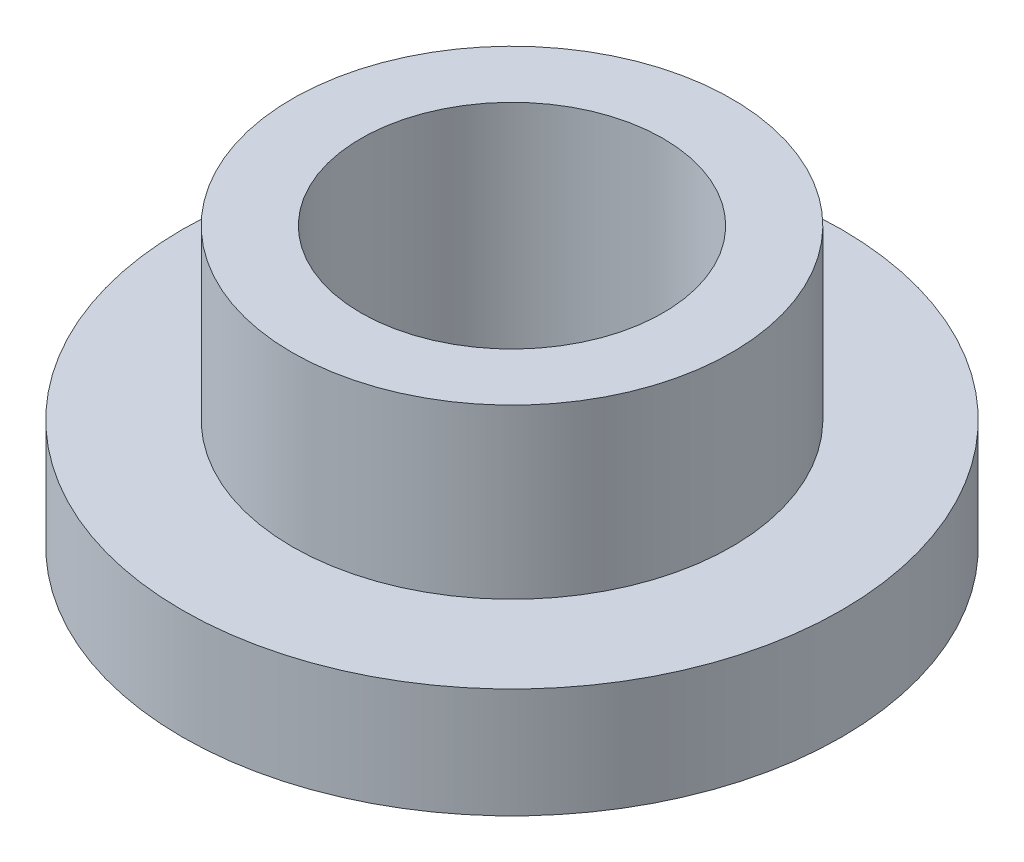
ISO-10303-21;
HEADER;
FILE_DESCRIPTION(('STEP AP214'),'2;1');
FILE_NAME('part.step','',(''),(''),'','','');
FILE_SCHEMA(('AUTOMOTIVE_DESIGN { 1 0 10303 214 1 1 1 1 }'));
ENDSEC;
DATA;
#1=APPLICATION_CONTEXT('core data for automotive mechanical design processes');
#2=APPLICATION_PROTOCOL_DEFINITION('international standard','automotive_design',2000,#1);
#3=PRODUCT_CONTEXT('',#1,'mechanical');
#4=PRODUCT('Part','Part','',(#3));
#5=PRODUCT_RELATED_PRODUCT_CATEGORY('part','',(#4));
#6=PRODUCT_DEFINITION_FORMATION('','',#4);
#7=PRODUCT_DEFINITION_CONTEXT('part definition',#1,'design');
#8=PRODUCT_DEFINITION('design','',#6,#7);
#9=PRODUCT_DEFINITION_SHAPE('','',#8);
#10=(LENGTH_UNIT() NAMED_UNIT(*) SI_UNIT(.MILLI.,.METRE.));
#11=(NAMED_UNIT(*) PLANE_ANGLE_UNIT() SI_UNIT($,.RADIAN.));
#12=(NAMED_UNIT(*) SI_UNIT($,.STERADIAN.) SOLID_ANGLE_UNIT());
#13=UNCERTAINTY_MEASURE_WITH_UNIT(LENGTH_MEASURE(1.E-05),#10,'distance_accuracy_value','');
#14=(GEOMETRIC_REPRESENTATION_CONTEXT(3) GLOBAL_UNCERTAINTY_ASSIGNED_CONTEXT((#13)) GLOBAL_UNIT_ASSIGNED_CONTEXT((#10,
#11,#12)) REPRESENTATION_CONTEXT('',''));
#15=CARTESIAN_POINT('',(0.,0.,0.));
#16=DIRECTION('',(0.,0.,1.));
#17=DIRECTION('',(1.,0.,0.));
#18=AXIS2_PLACEMENT_3D('',#15,#16,#17);
#19=CARTESIAN_POINT('',(0.,1.5875,0.));
#20=DIRECTION('',(0.,1.,0.));
#21=DIRECTION('',(0.,0.,1.));
#22=AXIS2_PLACEMENT_3D('',#19,#20,#21);
#23=PLANE('',#22);
#24=CARTESIAN_POINT('',(0.,1.5875,0.));
#25=DIRECTION('',(0.,1.,0.));
#26=DIRECTION('',(0.,0.,1.));
#27=AXIS2_PLACEMENT_3D('',#24,#25,#26);
#28=CIRCLE('',#27,4.7625);
#29=CARTESIAN_POINT('',(0.,1.5875,4.7625));
#30=VERTEX_POINT('',#29);
#31=EDGE_CURVE('E10',#30,#30,#28,.T.);
#32=ORIENTED_EDGE('',*,*,#31,.T.);
#33=EDGE_LOOP('',(#32));
#34=FACE_BOUND('',#33,.T.);
#35=CARTESIAN_POINT('',(0.,1.5875,0.));
#36=DIRECTION('',(0.,1.,0.));
#37=DIRECTION('',(0.,0.,1.));
#38=AXIS2_PLACEMENT_3D('',#35,#36,#37);
#39=CIRCLE('',#38,3.175);
#40=CARTESIAN_POINT('',(0.,1.5875,3.175));
#41=VERTEX_POINT('',#40);
#42=EDGE_CURVE('E53',#41,#41,#39,.T.);
#43=ORIENTED_EDGE('',*,*,#42,.F.);
#44=EDGE_LOOP('',(#43));
#45=FACE_BOUND('',#44,.T.);
#46=ADVANCED_FACE('F37',(#34,#45),#23,.T.);
#47=CARTESIAN_POINT('',(0.,0.,0.));
#48=DIRECTION('',(0.,1.,0.));
#49=DIRECTION('',(0.,0.,1.));
#50=AXIS2_PLACEMENT_3D('',#47,#48,#49);
#51=PLANE('',#50);
#52=CARTESIAN_POINT('',(0.,0.,0.));
#53=DIRECTION('',(0.,1.,0.));
#54=DIRECTION('',(0.,0.,1.));
#55=AXIS2_PLACEMENT_3D('',#52,#53,#54);
#56=CIRCLE('',#55,4.7625);
#57=CARTESIAN_POINT('',(0.,0.,4.7625));
#58=VERTEX_POINT('',#57);
#59=EDGE_CURVE('E41',#58,#58,#56,.T.);
#60=ORIENTED_EDGE('',*,*,#59,.F.);
#61=EDGE_LOOP('',(#60));
#62=FACE_BOUND('',#61,.T.);
#63=CARTESIAN_POINT('',(0.,0.,0.));
#64=DIRECTION('',(0.,1.,0.));
#65=DIRECTION('',(0.,0.,1.));
#66=AXIS2_PLACEMENT_3D('',#63,#64,#65);
#67=CIRCLE('',#66,2.1828125);
#68=CARTESIAN_POINT('',(0.,0.,2.1828125));
#69=VERTEX_POINT('',#68);
#70=EDGE_CURVE('E48',#69,#69,#67,.T.);
#71=ORIENTED_EDGE('',*,*,#70,.T.);
#72=EDGE_LOOP('',(#71));
#73=FACE_BOUND('',#72,.T.);
#74=ADVANCED_FACE('F78',(#62,#73),#51,.F.);
#75=CARTESIAN_POINT('',(0.,1.5875,0.));
#76=DIRECTION('',(0.,-1.,0.));
#77=DIRECTION('',(0.,0.,-1.));
#78=AXIS2_PLACEMENT_3D('',#75,#76,#77);
#79=CYLINDRICAL_SURFACE('',#78,4.7625);
#80=ORIENTED_EDGE('',*,*,#31,.F.);
#81=EDGE_LOOP('',(#80));
#82=FACE_BOUND('',#81,.T.);
#83=ORIENTED_EDGE('',*,*,#59,.T.);
#84=EDGE_LOOP('',(#83));
#85=FACE_BOUND('',#84,.T.);
#86=ADVANCED_FACE('F39',(#82,#85),#79,.T.);
#87=CARTESIAN_POINT('',(0.,1.5875,0.));
#88=DIRECTION('',(0.,-1.,0.));
#89=DIRECTION('',(0.,0.,-1.));
#90=AXIS2_PLACEMENT_3D('',#87,#88,#89);
#91=CYLINDRICAL_SURFACE('',#90,2.1828125);
#92=ORIENTED_EDGE('',*,*,#70,.F.);
#93=EDGE_LOOP('',(#92));
#94=FACE_BOUND('',#93,.T.);
#95=CARTESIAN_POINT('',(0.,4.016375,0.));
#96=DIRECTION('',(0.,1.,0.));
#97=DIRECTION('',(0.,0.,1.));
#98=AXIS2_PLACEMENT_3D('',#95,#96,#97);
#99=CIRCLE('',#98,2.1828125);
#100=CARTESIAN_POINT('',(0.,4.016375,2.1828125));
#101=VERTEX_POINT('',#100);
#102=EDGE_CURVE('E56',#101,#101,#99,.T.);
#103=ORIENTED_EDGE('',*,*,#102,.T.);
#104=EDGE_LOOP('',(#103));
#105=FACE_BOUND('',#104,.T.);
#106=ADVANCED_FACE('F62',(#94,#105),#91,.F.);
#107=CARTESIAN_POINT('',(0.,4.016375,0.));
#108=DIRECTION('',(0.,1.,0.));
#109=DIRECTION('',(0.,0.,1.));
#110=AXIS2_PLACEMENT_3D('',#107,#108,#109);
#111=PLANE('',#110);
#112=CARTESIAN_POINT('',(0.,4.016375,0.));
#113=DIRECTION('',(0.,1.,0.));
#114=DIRECTION('',(0.,0.,1.));
#115=AXIS2_PLACEMENT_3D('',#112,#113,#114);
#116=CIRCLE('',#115,3.175);
#117=CARTESIAN_POINT('',(0.,4.016375,3.175));
#118=VERTEX_POINT('',#117);
#119=EDGE_CURVE('E52',#118,#118,#116,.T.);
#120=ORIENTED_EDGE('',*,*,#119,.T.);
#121=EDGE_LOOP('',(#120));
#122=FACE_BOUND('',#121,.T.);
#123=ORIENTED_EDGE('',*,*,#102,.F.);
#124=EDGE_LOOP('',(#123));
#125=FACE_BOUND('',#124,.T.);
#126=ADVANCED_FACE('F64',(#122,#125),#111,.T.);
#127=CARTESIAN_POINT('',(0.,4.016375,0.));
#128=DIRECTION('',(0.,-1.,0.));
#129=DIRECTION('',(0.,0.,-1.));
#130=AXIS2_PLACEMENT_3D('',#127,#128,#129);
#131=CYLINDRICAL_SURFACE('',#130,3.175);
#132=ORIENTED_EDGE('',*,*,#119,.F.);
#133=EDGE_LOOP('',(#132));
#134=FACE_BOUND('',#133,.T.);
#135=ORIENTED_EDGE('',*,*,#42,.T.);
#136=EDGE_LOOP('',(#135));
#137=FACE_BOUND('',#136,.T.);
#138=ADVANCED_FACE('F66',(#134,#137),#131,.T.);
#139=CLOSED_SHELL('',(#46,#74,#86,#106,#126,#138));
#140=MANIFOLD_SOLID_BREP('B2',#139);
#141=ADVANCED_BREP_SHAPE_REPRESENTATION('',(#18,#140),#14);
#142=SHAPE_DEFINITION_REPRESENTATION(#9,#141);
ENDSEC;
END-ISO-10303-21;
